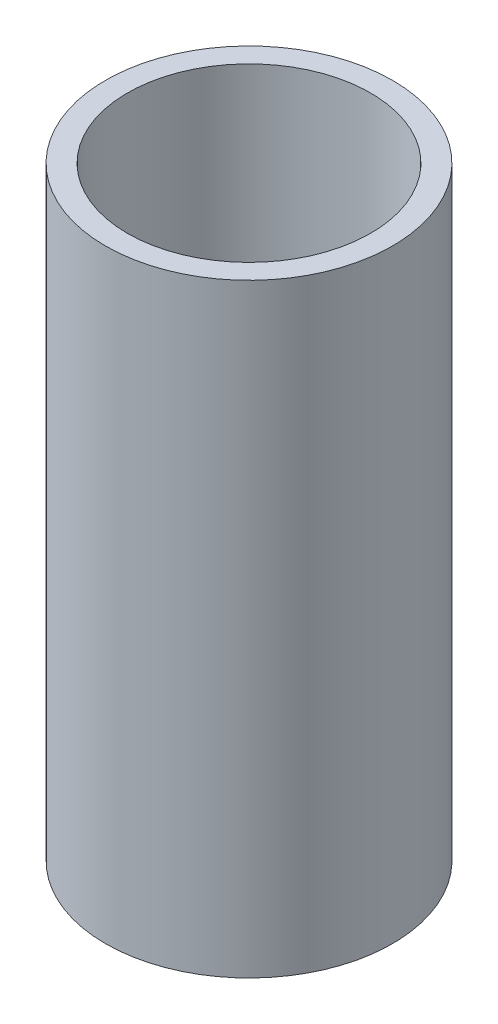
ISO-10303-21;
HEADER;
FILE_DESCRIPTION(('STEP AP214'),'2;1');
FILE_NAME('part.step','',(''),(''),'','','');
FILE_SCHEMA(('AUTOMOTIVE_DESIGN { 1 0 10303 214 1 1 1 1 }'));
ENDSEC;
DATA;
#1=APPLICATION_CONTEXT('core data for automotive mechanical design processes');
#2=APPLICATION_PROTOCOL_DEFINITION('international standard','automotive_design',2000,#1);
#3=PRODUCT_CONTEXT('',#1,'mechanical');
#4=PRODUCT('Part','Part','',(#3));
#5=PRODUCT_RELATED_PRODUCT_CATEGORY('part','',(#4));
#6=PRODUCT_DEFINITION_FORMATION('','',#4);
#7=PRODUCT_DEFINITION_CONTEXT('part definition',#1,'design');
#8=PRODUCT_DEFINITION('design','',#6,#7);
#9=PRODUCT_DEFINITION_SHAPE('','',#8);
#10=(LENGTH_UNIT() NAMED_UNIT(*) SI_UNIT(.MILLI.,.METRE.));
#11=(NAMED_UNIT(*) PLANE_ANGLE_UNIT() SI_UNIT($,.RADIAN.));
#12=(NAMED_UNIT(*) SI_UNIT($,.STERADIAN.) SOLID_ANGLE_UNIT());
#13=UNCERTAINTY_MEASURE_WITH_UNIT(LENGTH_MEASURE(1.E-05),#10,'distance_accuracy_value','');
#14=(GEOMETRIC_REPRESENTATION_CONTEXT(3) GLOBAL_UNCERTAINTY_ASSIGNED_CONTEXT((#13)) GLOBAL_UNIT_ASSIGNED_CONTEXT((#10,
#11,#12)) REPRESENTATION_CONTEXT('',''));
#15=CARTESIAN_POINT('',(0.,0.,0.));
#16=DIRECTION('',(0.,0.,1.));
#17=DIRECTION('',(1.,0.,0.));
#18=AXIS2_PLACEMENT_3D('',#15,#16,#17);
#19=CARTESIAN_POINT('',(0.,-50.8,0.));
#20=DIRECTION('',(0.,1.,0.));
#21=DIRECTION('',(0.,0.,1.));
#22=AXIS2_PLACEMENT_3D('',#19,#20,#21);
#23=CYLINDRICAL_SURFACE('',#22,20.447);
#24=CARTESIAN_POINT('',(0.,50.8,0.));
#25=DIRECTION('',(0.,1.,0.));
#26=DIRECTION('',(0.,0.,1.));
#27=AXIS2_PLACEMENT_3D('',#24,#25,#26);
#28=CIRCLE('',#27,20.447);
#29=CARTESIAN_POINT('',(0.,50.8,20.447));
#30=VERTEX_POINT('',#29);
#31=EDGE_CURVE('E18',#30,#30,#28,.F.);
#32=ORIENTED_EDGE('',*,*,#31,.F.);
#33=EDGE_LOOP('',(#32));
#34=FACE_BOUND('',#33,.T.);
#35=CARTESIAN_POINT('',(0.,-50.8,0.));
#36=DIRECTION('',(0.,1.,0.));
#37=DIRECTION('',(0.,0.,1.));
#38=AXIS2_PLACEMENT_3D('',#35,#36,#37);
#39=CIRCLE('',#38,20.447);
#40=CARTESIAN_POINT('',(0.,-50.8,20.447));
#41=VERTEX_POINT('',#40);
#42=EDGE_CURVE('E27',#41,#41,#39,.F.);
#43=ORIENTED_EDGE('',*,*,#42,.T.);
#44=EDGE_LOOP('',(#43));
#45=FACE_BOUND('',#44,.T.);
#46=ADVANCED_FACE('F15',(#34,#45),#23,.F.);
#47=CARTESIAN_POINT('',(0.,50.8,0.));
#48=DIRECTION('',(0.,1.,0.));
#49=DIRECTION('',(0.,0.,1.));
#50=AXIS2_PLACEMENT_3D('',#47,#48,#49);
#51=PLANE('',#50);
#52=ORIENTED_EDGE('',*,*,#31,.T.);
#53=EDGE_LOOP('',(#52));
#54=FACE_BOUND('',#53,.T.);
#55=CARTESIAN_POINT('',(0.,50.8,0.));
#56=DIRECTION('',(0.,1.,0.));
#57=DIRECTION('',(0.,0.,1.));
#58=AXIS2_PLACEMENT_3D('',#55,#56,#57);
#59=CIRCLE('',#58,24.13);
#60=CARTESIAN_POINT('',(0.,50.8,24.13));
#61=VERTEX_POINT('',#60);
#62=EDGE_CURVE('E22',#61,#61,#59,.F.);
#63=ORIENTED_EDGE('',*,*,#62,.F.);
#64=EDGE_LOOP('',(#63));
#65=FACE_BOUND('',#64,.T.);
#66=ADVANCED_FACE('F35',(#54,#65),#51,.T.);
#67=CARTESIAN_POINT('',(0.,-50.8,0.));
#68=DIRECTION('',(0.,1.,0.));
#69=DIRECTION('',(0.,0.,1.));
#70=AXIS2_PLACEMENT_3D('',#67,#68,#69);
#71=PLANE('',#70);
#72=ORIENTED_EDGE('',*,*,#42,.F.);
#73=EDGE_LOOP('',(#72));
#74=FACE_BOUND('',#73,.T.);
#75=CARTESIAN_POINT('',(0.,-50.8,0.));
#76=DIRECTION('',(0.,1.,0.));
#77=DIRECTION('',(0.,0.,1.));
#78=AXIS2_PLACEMENT_3D('',#75,#76,#77);
#79=CIRCLE('',#78,24.13);
#80=CARTESIAN_POINT('',(0.,-50.8,24.13));
#81=VERTEX_POINT('',#80);
#82=EDGE_CURVE('E10',#81,#81,#79,.T.);
#83=ORIENTED_EDGE('',*,*,#82,.F.);
#84=EDGE_LOOP('',(#83));
#85=FACE_BOUND('',#84,.T.);
#86=ADVANCED_FACE('F43',(#74,#85),#71,.F.);
#87=CARTESIAN_POINT('',(0.,-50.8,0.));
#88=DIRECTION('',(0.,1.,0.));
#89=DIRECTION('',(0.,0.,1.));
#90=AXIS2_PLACEMENT_3D('',#87,#88,#89);
#91=CYLINDRICAL_SURFACE('',#90,24.13);
#92=ORIENTED_EDGE('',*,*,#62,.T.);
#93=EDGE_LOOP('',(#92));
#94=FACE_BOUND('',#93,.T.);
#95=ORIENTED_EDGE('',*,*,#82,.T.);
#96=EDGE_LOOP('',(#95));
#97=FACE_BOUND('',#96,.T.);
#98=ADVANCED_FACE('F44',(#94,#97),#91,.T.);
#99=CLOSED_SHELL('',(#46,#66,#86,#98));
#100=MANIFOLD_SOLID_BREP('B1',#99);
#101=ADVANCED_BREP_SHAPE_REPRESENTATION('',(#18,#100),#14);
#102=SHAPE_DEFINITION_REPRESENTATION(#9,#101);
ENDSEC;
END-ISO-10303-21;
